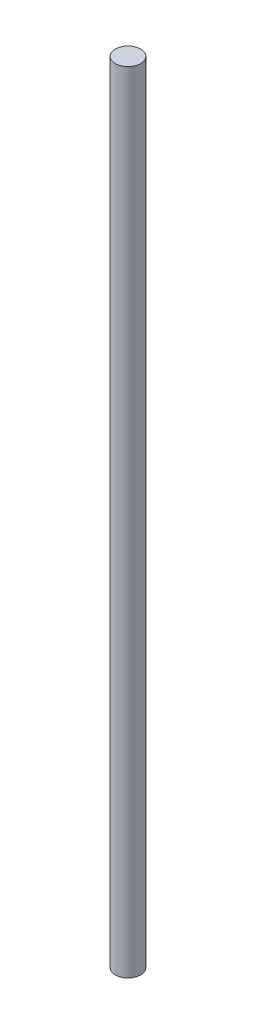
ISO-10303-21;
HEADER;
FILE_DESCRIPTION(('STEP AP214'),'2;1');
FILE_NAME('part.step','',(''),(''),'','','');
FILE_SCHEMA(('AUTOMOTIVE_DESIGN { 1 0 10303 214 1 1 1 1 }'));
ENDSEC;
DATA;
#1=APPLICATION_CONTEXT('core data for automotive mechanical design processes');
#2=APPLICATION_PROTOCOL_DEFINITION('international standard','automotive_design',2000,#1);
#3=PRODUCT_CONTEXT('',#1,'mechanical');
#4=PRODUCT('Part','Part','',(#3));
#5=PRODUCT_RELATED_PRODUCT_CATEGORY('part','',(#4));
#6=PRODUCT_DEFINITION_FORMATION('','',#4);
#7=PRODUCT_DEFINITION_CONTEXT('part definition',#1,'design');
#8=PRODUCT_DEFINITION('design','',#6,#7);
#9=PRODUCT_DEFINITION_SHAPE('','',#8);
#10=(LENGTH_UNIT() NAMED_UNIT(*) SI_UNIT(.MILLI.,.METRE.));
#11=(NAMED_UNIT(*) PLANE_ANGLE_UNIT() SI_UNIT($,.RADIAN.));
#12=(NAMED_UNIT(*) SI_UNIT($,.STERADIAN.) SOLID_ANGLE_UNIT());
#13=UNCERTAINTY_MEASURE_WITH_UNIT(LENGTH_MEASURE(1.E-05),#10,'distance_accuracy_value','');
#14=(GEOMETRIC_REPRESENTATION_CONTEXT(3) GLOBAL_UNCERTAINTY_ASSIGNED_CONTEXT((#13)) GLOBAL_UNIT_ASSIGNED_CONTEXT((#10,
#11,#12)) REPRESENTATION_CONTEXT('',''));
#15=CARTESIAN_POINT('',(0.,0.,0.));
#16=DIRECTION('',(0.,0.,1.));
#17=DIRECTION('',(1.,0.,0.));
#18=AXIS2_PLACEMENT_3D('',#15,#16,#17);
#19=CARTESIAN_POINT('',(-5.13407554104392,250.,-4.6554752787432));
#20=DIRECTION('',(0.,-1.,0.));
#21=DIRECTION('',(0.,0.,-1.));
#22=AXIS2_PLACEMENT_3D('',#19,#20,#21);
#23=CYLINDRICAL_SURFACE('',#22,4.);
#24=CARTESIAN_POINT('',(-5.13407554104392,250.,-4.6554752787432));
#25=DIRECTION('',(0.,1.,0.));
#26=DIRECTION('',(0.,0.,1.));
#27=AXIS2_PLACEMENT_3D('',#24,#25,#26);
#28=CIRCLE('',#27,4.);
#29=CARTESIAN_POINT('',(-5.13407554104392,250.,-0.6554752787432));
#30=VERTEX_POINT('',#29);
#31=EDGE_CURVE('E10',#30,#30,#28,.T.);
#32=ORIENTED_EDGE('',*,*,#31,.F.);
#33=EDGE_LOOP('',(#32));
#34=FACE_BOUND('',#33,.T.);
#35=CARTESIAN_POINT('',(-5.13407554104392,0.,-4.6554752787432));
#36=DIRECTION('',(0.,1.,0.));
#37=DIRECTION('',(0.,0.,1.));
#38=AXIS2_PLACEMENT_3D('',#35,#36,#37);
#39=CIRCLE('',#38,4.);
#40=CARTESIAN_POINT('',(-5.13407554104392,0.,-0.6554752787432));
#41=VERTEX_POINT('',#40);
#42=EDGE_CURVE('E34',#41,#41,#39,.T.);
#43=ORIENTED_EDGE('',*,*,#42,.T.);
#44=EDGE_LOOP('',(#43));
#45=FACE_BOUND('',#44,.T.);
#46=ADVANCED_FACE('F31',(#34,#45),#23,.T.);
#47=CARTESIAN_POINT('',(-5.13407554104392,250.,-4.6554752787432));
#48=DIRECTION('',(0.,1.,0.));
#49=DIRECTION('',(0.,0.,1.));
#50=AXIS2_PLACEMENT_3D('',#47,#48,#49);
#51=PLANE('',#50);
#52=ORIENTED_EDGE('',*,*,#31,.T.);
#53=EDGE_LOOP('',(#52));
#54=FACE_BOUND('',#53,.T.);
#55=ADVANCED_FACE('F46',(#54),#51,.T.);
#56=CARTESIAN_POINT('',(-5.13407554104392,0.,-4.6554752787432));
#57=DIRECTION('',(0.,1.,0.));
#58=DIRECTION('',(0.,0.,1.));
#59=AXIS2_PLACEMENT_3D('',#56,#57,#58);
#60=PLANE('',#59);
#61=ORIENTED_EDGE('',*,*,#42,.F.);
#62=EDGE_LOOP('',(#61));
#63=FACE_BOUND('',#62,.T.);
#64=ADVANCED_FACE('F44',(#63),#60,.F.);
#65=CLOSED_SHELL('',(#46,#55,#64));
#66=MANIFOLD_SOLID_BREP('B2',#65);
#67=ADVANCED_BREP_SHAPE_REPRESENTATION('',(#18,#66),#14);
#68=SHAPE_DEFINITION_REPRESENTATION(#9,#67);
ENDSEC;
END-ISO-10303-21;
